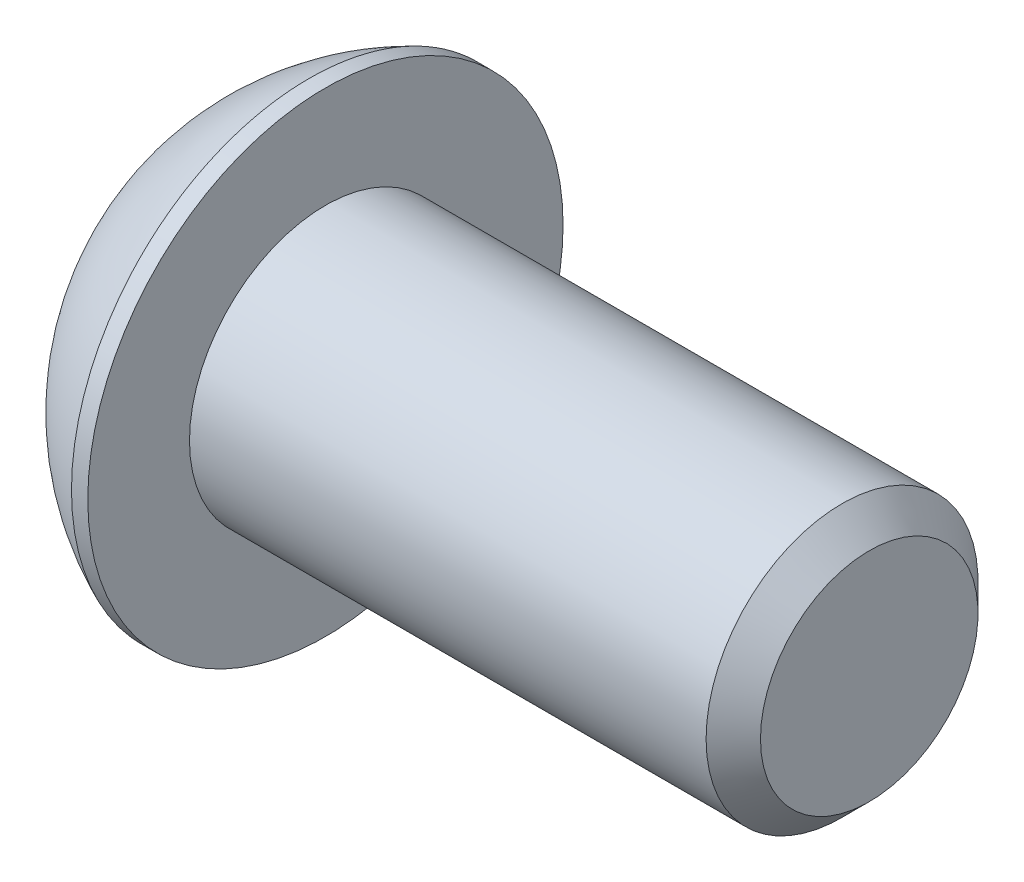
ISO-10303-21;
HEADER;
FILE_DESCRIPTION(('STEP AP214'),'2;1');
FILE_NAME('part.step','',(''),(''),'','','');
FILE_SCHEMA(('AUTOMOTIVE_DESIGN { 1 0 10303 214 1 1 1 1 }'));
ENDSEC;
DATA;
#1=APPLICATION_CONTEXT('core data for automotive mechanical design processes');
#2=APPLICATION_PROTOCOL_DEFINITION('international standard','automotive_design',2000,#1);
#3=PRODUCT_CONTEXT('',#1,'mechanical');
#4=PRODUCT('Part','Part','',(#3));
#5=PRODUCT_RELATED_PRODUCT_CATEGORY('part','',(#4));
#6=PRODUCT_DEFINITION_FORMATION('','',#4);
#7=PRODUCT_DEFINITION_CONTEXT('part definition',#1,'design');
#8=PRODUCT_DEFINITION('design','',#6,#7);
#9=PRODUCT_DEFINITION_SHAPE('','',#8);
#10=(LENGTH_UNIT() NAMED_UNIT(*) SI_UNIT(.MILLI.,.METRE.));
#11=(NAMED_UNIT(*) PLANE_ANGLE_UNIT() SI_UNIT($,.RADIAN.));
#12=(NAMED_UNIT(*) SI_UNIT($,.STERADIAN.) SOLID_ANGLE_UNIT());
#13=UNCERTAINTY_MEASURE_WITH_UNIT(LENGTH_MEASURE(1.E-05),#10,'distance_accuracy_value','');
#14=(GEOMETRIC_REPRESENTATION_CONTEXT(3) GLOBAL_UNCERTAINTY_ASSIGNED_CONTEXT((#13)) GLOBAL_UNIT_ASSIGNED_CONTEXT((#10,
#11,#12)) REPRESENTATION_CONTEXT('',''));
#15=CARTESIAN_POINT('',(0.,0.,0.));
#16=DIRECTION('',(0.,0.,1.));
#17=DIRECTION('',(1.,0.,0.));
#18=AXIS2_PLACEMENT_3D('',#15,#16,#17);
#19=CARTESIAN_POINT('',(1.32080000000034,0.,0.));
#20=DIRECTION('',(-1.,0.,0.));
#21=DIRECTION('',(0.,0.,1.));
#22=AXIS2_PLACEMENT_3D('',#19,#20,#21);
#23=CONICAL_SURFACE('',#22,1.1937999999998,1.04719755119608);
#24=CARTESIAN_POINT('',(2.01004075135902,0.,-4.44089209850063E-13));
#25=VERTEX_POINT('',#24);
#26=VERTEX_LOOP('',#25);
#27=FACE_BOUND('',#26,.T.);
#28=CARTESIAN_POINT('',(1.32080000000009,0.,0.));
#29=DIRECTION('',(-1.,0.,0.));
#30=DIRECTION('',(0.,0.,1.));
#31=AXIS2_PLACEMENT_3D('',#28,#29,#30);
#32=CIRCLE('',#31,1.19380000000024);
#33=CARTESIAN_POINT('',(1.32080000000009,0.,1.19380000000024));
#34=VERTEX_POINT('',#33);
#35=EDGE_CURVE('E20',#34,#34,#32,.T.);
#36=ORIENTED_EDGE('',*,*,#35,.T.);
#37=EDGE_LOOP('',(#36));
#38=FACE_BOUND('',#37,.T.);
#39=ADVANCED_FACE('F17',(#27,#38),#23,.F.);
#40=CARTESIAN_POINT('',(1.3208,-2.29135888084633,0.));
#41=DIRECTION('',(1.,0.,0.));
#42=DIRECTION('',(0.,0.,-1.));
#43=AXIS2_PLACEMENT_3D('',#40,#41,#42);
#44=PLANE('',#43);
#45=DIRECTION('',(0.,1.,0.));
#46=VECTOR('',#45,1.);
#47=CARTESIAN_POINT('',(1.3208,-1.14567944042316,1.984375));
#48=LINE('',#47,#46);
#49=CARTESIAN_POINT('',(1.3208,1.14567944042316,1.984375));
#50=VERTEX_POINT('',#49);
#51=CARTESIAN_POINT('',(1.3208,-1.14567944042316,1.984375));
#52=VERTEX_POINT('',#51);
#53=EDGE_CURVE('E69',#50,#52,#48,.F.);
#54=ORIENTED_EDGE('',*,*,#53,.F.);
#55=DIRECTION('',(0.,0.5,-0.866025403784439));
#56=VECTOR('',#55,1.);
#57=CARTESIAN_POINT('',(1.3208,1.14567944042316,1.984375));
#58=LINE('',#57,#56);
#59=CARTESIAN_POINT('',(1.3208,2.29135888084633,0.));
#60=VERTEX_POINT('',#59);
#61=EDGE_CURVE('E292',#60,#50,#58,.F.);
#62=ORIENTED_EDGE('',*,*,#61,.F.);
#63=DIRECTION('',(0.,-0.5,-0.866025403784439));
#64=VECTOR('',#63,1.);
#65=CARTESIAN_POINT('',(1.3208,2.29135888084633,0.));
#66=LINE('',#65,#64);
#67=CARTESIAN_POINT('',(1.3208,1.14567944042316,-1.984375));
#68=VERTEX_POINT('',#67);
#69=EDGE_CURVE('E296',#68,#60,#66,.F.);
#70=ORIENTED_EDGE('',*,*,#69,.F.);
#71=DIRECTION('',(0.,1.,0.));
#72=VECTOR('',#71,1.);
#73=CARTESIAN_POINT('',(1.3208,1.14567944042316,-1.984375));
#74=LINE('',#73,#72);
#75=CARTESIAN_POINT('',(1.3208,-1.14567944042316,-1.984375));
#76=VERTEX_POINT('',#75);
#77=EDGE_CURVE('E301',#76,#68,#74,.T.);
#78=ORIENTED_EDGE('',*,*,#77,.F.);
#79=DIRECTION('',(0.,-0.500000000000001,0.866025403784438));
#80=VECTOR('',#79,1.);
#81=CARTESIAN_POINT('',(1.3208,-1.14567944042316,-1.984375));
#82=LINE('',#81,#80);
#83=CARTESIAN_POINT('',(1.3208,-2.29135888084633,0.));
#84=VERTEX_POINT('',#83);
#85=EDGE_CURVE('E306',#84,#76,#82,.F.);
#86=ORIENTED_EDGE('',*,*,#85,.F.);
#87=DIRECTION('',(0.,0.500000000000001,0.866025403784438));
#88=VECTOR('',#87,1.);
#89=CARTESIAN_POINT('',(1.3208,-2.29135888084633,0.));
#90=LINE('',#89,#88);
#91=EDGE_CURVE('E82',#52,#84,#90,.F.);
#92=ORIENTED_EDGE('',*,*,#91,.F.);
#93=EDGE_LOOP('',(#54,#62,#70,#78,#86,#92));
#94=FACE_BOUND('',#93,.T.);
#95=ORIENTED_EDGE('',*,*,#35,.F.);
#96=EDGE_LOOP('',(#95));
#97=FACE_BOUND('',#96,.T.);
#98=ADVANCED_FACE('F75',(#94,#97),#44,.F.);
#99=CARTESIAN_POINT('',(1.3208,-1.14567944042316,1.984375));
#100=DIRECTION('',(0.,0.,-1.));
#101=DIRECTION('',(0.,1.,0.));
#102=AXIS2_PLACEMENT_3D('',#99,#100,#101);
#103=PLANE('',#102);
#104=ORIENTED_EDGE('',*,*,#53,.T.);
#105=DIRECTION('',(1.,0.,0.));
#106=VECTOR('',#105,1.);
#107=CARTESIAN_POINT('',(1.3208,-1.14567944042316,1.984375));
#108=LINE('',#107,#106);
#109=CARTESIAN_POINT('',(0.,-1.14567944042316,1.984375));
#110=VERTEX_POINT('',#109);
#111=EDGE_CURVE('E79',#110,#52,#108,.T.);
#112=ORIENTED_EDGE('',*,*,#111,.F.);
#113=DIRECTION('',(0.,1.,0.));
#114=VECTOR('',#113,1.);
#115=CARTESIAN_POINT('',(0.,0.,1.984375));
#116=LINE('',#115,#114);
#117=CARTESIAN_POINT('',(0.,1.14567944042316,1.984375));
#118=VERTEX_POINT('',#117);
#119=EDGE_CURVE('E286',#118,#110,#116,.F.);
#120=ORIENTED_EDGE('',*,*,#119,.F.);
#121=DIRECTION('',(1.,0.,0.));
#122=VECTOR('',#121,1.);
#123=CARTESIAN_POINT('',(1.3208,1.14567944042316,1.984375));
#124=LINE('',#123,#122);
#125=EDGE_CURVE('E289',#50,#118,#124,.F.);
#126=ORIENTED_EDGE('',*,*,#125,.F.);
#127=EDGE_LOOP('',(#104,#112,#120,#126));
#128=FACE_BOUND('',#127,.T.);
#129=ADVANCED_FACE('F128',(#128),#103,.T.);
#130=CARTESIAN_POINT('',(1.3208,-2.29135888084633,0.));
#131=DIRECTION('',(0.,0.866025403784438,-0.500000000000001));
#132=DIRECTION('',(0.,0.500000000000001,0.866025403784438));
#133=AXIS2_PLACEMENT_3D('',#130,#131,#132);
#134=PLANE('',#133);
#135=ORIENTED_EDGE('',*,*,#91,.T.);
#136=DIRECTION('',(1.,0.,0.));
#137=VECTOR('',#136,1.);
#138=CARTESIAN_POINT('',(1.3208,-2.29135888084633,0.));
#139=LINE('',#138,#137);
#140=CARTESIAN_POINT('',(0.,-2.29135888084633,0.));
#141=VERTEX_POINT('',#140);
#142=EDGE_CURVE('E308',#141,#84,#139,.T.);
#143=ORIENTED_EDGE('',*,*,#142,.F.);
#144=DIRECTION('',(0.,-0.500000000000001,-0.866025403784438));
#145=VECTOR('',#144,1.);
#146=CARTESIAN_POINT('',(0.,-1.14567944042316,1.984375));
#147=LINE('',#146,#145);
#148=EDGE_CURVE('E283',#110,#141,#147,.T.);
#149=ORIENTED_EDGE('',*,*,#148,.F.);
#150=ORIENTED_EDGE('',*,*,#111,.T.);
#151=EDGE_LOOP('',(#135,#143,#149,#150));
#152=FACE_BOUND('',#151,.T.);
#153=ADVANCED_FACE('F124',(#152),#134,.T.);
#154=CARTESIAN_POINT('',(1.3208,-1.14567944042316,-1.984375));
#155=DIRECTION('',(0.,0.866025403784438,0.500000000000001));
#156=DIRECTION('',(0.,-0.500000000000001,0.866025403784438));
#157=AXIS2_PLACEMENT_3D('',#154,#155,#156);
#158=PLANE('',#157);
#159=ORIENTED_EDGE('',*,*,#85,.T.);
#160=DIRECTION('',(1.,0.,0.));
#161=VECTOR('',#160,1.);
#162=CARTESIAN_POINT('',(1.3208,-1.14567944042316,-1.984375));
#163=LINE('',#162,#161);
#164=CARTESIAN_POINT('',(0.,-1.14567944042316,-1.984375));
#165=VERTEX_POINT('',#164);
#166=EDGE_CURVE('E303',#165,#76,#163,.T.);
#167=ORIENTED_EDGE('',*,*,#166,.F.);
#168=DIRECTION('',(0.,0.500000000000001,-0.866025403784438));
#169=VECTOR('',#168,1.);
#170=CARTESIAN_POINT('',(0.,-2.29135888084633,0.));
#171=LINE('',#170,#169);
#172=EDGE_CURVE('E280',#141,#165,#171,.T.);
#173=ORIENTED_EDGE('',*,*,#172,.F.);
#174=ORIENTED_EDGE('',*,*,#142,.T.);
#175=EDGE_LOOP('',(#159,#167,#173,#174));
#176=FACE_BOUND('',#175,.T.);
#177=ADVANCED_FACE('F120',(#176),#158,.T.);
#178=CARTESIAN_POINT('',(1.3208,1.14567944042316,-1.984375));
#179=DIRECTION('',(0.,0.,1.));
#180=DIRECTION('',(1.,0.,0.));
#181=AXIS2_PLACEMENT_3D('',#178,#179,#180);
#182=PLANE('',#181);
#183=ORIENTED_EDGE('',*,*,#77,.T.);
#184=DIRECTION('',(1.,0.,0.));
#185=VECTOR('',#184,1.);
#186=CARTESIAN_POINT('',(1.3208,1.14567944042316,-1.984375));
#187=LINE('',#186,#185);
#188=CARTESIAN_POINT('',(0.,1.14567944042316,-1.984375));
#189=VERTEX_POINT('',#188);
#190=EDGE_CURVE('E298',#189,#68,#187,.T.);
#191=ORIENTED_EDGE('',*,*,#190,.F.);
#192=DIRECTION('',(0.,1.,0.));
#193=VECTOR('',#192,1.);
#194=CARTESIAN_POINT('',(0.,0.,-1.984375));
#195=LINE('',#194,#193);
#196=EDGE_CURVE('E277',#165,#189,#195,.T.);
#197=ORIENTED_EDGE('',*,*,#196,.F.);
#198=ORIENTED_EDGE('',*,*,#166,.T.);
#199=EDGE_LOOP('',(#183,#191,#197,#198));
#200=FACE_BOUND('',#199,.T.);
#201=ADVANCED_FACE('F117',(#200),#182,.T.);
#202=CARTESIAN_POINT('',(1.3208,2.29135888084633,0.));
#203=DIRECTION('',(0.,-0.866025403784439,0.5));
#204=DIRECTION('',(0.,-0.5,-0.866025403784439));
#205=AXIS2_PLACEMENT_3D('',#202,#203,#204);
#206=PLANE('',#205);
#207=ORIENTED_EDGE('',*,*,#69,.T.);
#208=DIRECTION('',(1.,0.,0.));
#209=VECTOR('',#208,1.);
#210=CARTESIAN_POINT('',(1.3208,2.29135888084633,0.));
#211=LINE('',#210,#209);
#212=CARTESIAN_POINT('',(0.,2.29135888084633,0.));
#213=VERTEX_POINT('',#212);
#214=EDGE_CURVE('E35',#213,#60,#211,.T.);
#215=ORIENTED_EDGE('',*,*,#214,.F.);
#216=DIRECTION('',(0.,0.5,0.866025403784439));
#217=VECTOR('',#216,1.);
#218=CARTESIAN_POINT('',(0.,1.14567944042316,-1.984375));
#219=LINE('',#218,#217);
#220=EDGE_CURVE('E274',#189,#213,#219,.T.);
#221=ORIENTED_EDGE('',*,*,#220,.F.);
#222=ORIENTED_EDGE('',*,*,#190,.T.);
#223=EDGE_LOOP('',(#207,#215,#221,#222));
#224=FACE_BOUND('',#223,.T.);
#225=ADVANCED_FACE('F113',(#224),#206,.T.);
#226=CARTESIAN_POINT('',(1.3208,1.14567944042316,1.984375));
#227=DIRECTION('',(0.,-0.866025403784439,-0.5));
#228=DIRECTION('',(0.,0.5,-0.866025403784439));
#229=AXIS2_PLACEMENT_3D('',#226,#227,#228);
#230=PLANE('',#229);
#231=ORIENTED_EDGE('',*,*,#61,.T.);
#232=ORIENTED_EDGE('',*,*,#125,.T.);
#233=DIRECTION('',(0.,-0.5,0.866025403784438));
#234=VECTOR('',#233,1.);
#235=CARTESIAN_POINT('',(0.,2.29135888084633,0.));
#236=LINE('',#235,#234);
#237=EDGE_CURVE('E100',#213,#118,#236,.T.);
#238=ORIENTED_EDGE('',*,*,#237,.F.);
#239=ORIENTED_EDGE('',*,*,#214,.T.);
#240=EDGE_LOOP('',(#231,#232,#238,#239));
#241=FACE_BOUND('',#240,.T.);
#242=ADVANCED_FACE('F109',(#241),#230,.T.);
#243=CARTESIAN_POINT('',(0.,0.,0.));
#244=DIRECTION('',(-1.,0.,0.));
#245=DIRECTION('',(0.,0.,1.));
#246=AXIS2_PLACEMENT_3D('',#243,#244,#245);
#247=PLANE('',#246);
#248=ORIENTED_EDGE('',*,*,#220,.T.);
#249=ORIENTED_EDGE('',*,*,#237,.T.);
#250=ORIENTED_EDGE('',*,*,#119,.T.);
#251=ORIENTED_EDGE('',*,*,#148,.T.);
#252=ORIENTED_EDGE('',*,*,#172,.T.);
#253=ORIENTED_EDGE('',*,*,#196,.T.);
#254=EDGE_LOOP('',(#248,#249,#250,#251,#252,#253));
#255=FACE_BOUND('',#254,.T.);
#256=CARTESIAN_POINT('',(0.,2.77495,0.));
#257=CARTESIAN_POINT('',(0.,2.77494953309947,0.0779118937523459));
#258=CARTESIAN_POINT('',(0.,2.77166578388025,0.15583810591977));
#259=CARTESIAN_POINT('',(0.,2.75855213600204,0.311152012455904));
#260=CARTESIAN_POINT('',(0.,2.74872030471467,0.388539541019556));
#261=CARTESIAN_POINT('',(0.,2.72255472645676,0.542341518735717));
#262=CARTESIAN_POINT('',(-2.70414110576258E-13,2.70621065843663,0.618754223567578));
#263=CARTESIAN_POINT('',(2.71501725221868E-13,2.66713326915777,0.769973634286023));
#264=CARTESIAN_POINT('',(1.01274952524446E-12,2.64439476297869,0.844778983646282));
#265=CARTESIAN_POINT('',(1.81909959813207E-12,2.56690195943351,1.06566239301792));
#266=CARTESIAN_POINT('',(4.77081687541822E-13,2.50280672569928,1.20857954243987));
#267=CARTESIAN_POINT('',(-4.76232447128612E-13,2.35149826934097,1.48160874561538));
#268=CARTESIAN_POINT('',(0.,2.26428416790397,1.61172031233499));
#269=CARTESIAN_POINT('',(0.,2.1181093928834,1.79445660654268));
#270=CARTESIAN_POINT('',(0.,2.06678693791626,1.85333128513996));
#271=CARTESIAN_POINT('',(0.,1.95940522984449,1.96650727912792));
#272=CARTESIAN_POINT('',(0.,1.90335059143535,2.02081294920044));
#273=CARTESIAN_POINT('',(0.,1.78683891013963,2.12453280878582));
#274=CARTESIAN_POINT('',(0.,1.72637988450322,2.1739447713554));
#275=CARTESIAN_POINT('',(0.,1.60151968865711,2.26750481692908));
#276=CARTESIAN_POINT('',(0.,1.53711760864537,2.31165167810847));
#277=CARTESIAN_POINT('',(0.,1.33869902291632,2.43567242603944));
#278=CARTESIAN_POINT('',(0.,1.19934704110695,2.507235886628));
#279=CARTESIAN_POINT('',(0.,0.910681609121881,2.62590828672821));
#280=CARTESIAN_POINT('',(0.,0.761368265357398,2.67301748742278));
#281=CARTESIAN_POINT('',(0.,0.456932649466623,2.74151230664007));
#282=CARTESIAN_POINT('',(0.,0.301810346322584,2.76289778778721));
#283=CARTESIAN_POINT('',(0.,-0.00982263870895171,2.77931595661156));
#284=CARTESIAN_POINT('',(0.,-0.166333320596448,2.77434864428877));
#285=CARTESIAN_POINT('',(0.,-0.476280836814452,2.73822217653073));
#286=CARTESIAN_POINT('',(0.,-0.629717687555985,2.70706316096981));
#287=CARTESIAN_POINT('',(0.,-0.929254830044274,2.61937980771149));
#288=CARTESIAN_POINT('',(0.,-1.0753550434132,2.56285519909568));
#289=CARTESIAN_POINT('',(0.,-1.28570692598579,2.46037024128109));
#290=CARTESIAN_POINT('',(0.,-1.35439130022287,2.42323494812896));
#291=CARTESIAN_POINT('',(0.,-1.488391287199,2.34331277270256));
#292=CARTESIAN_POINT('',(0.,-1.55370767631787,2.30052720108831));
#293=CARTESIAN_POINT('',(0.,-1.68047292776594,2.20962421887055));
#294=CARTESIAN_POINT('',(0.,-1.7419235278682,2.16150923122348));
#295=CARTESIAN_POINT('',(0.,-1.86060297067992,2.06024311301283));
#296=CARTESIAN_POINT('',(0.,-1.91782768181715,2.0070871669763));
#297=CARTESIAN_POINT('',(0.,-2.08239462196651,1.8407220856554));
#298=CARTESIAN_POINT('',(0.,-2.18279764272601,1.72049499758422));
#299=CARTESIAN_POINT('',(0.,-2.36195754944063,1.46487629213018));
#300=CARTESIAN_POINT('',(0.,-2.44071525816758,1.32948525142807));
#301=CARTESIAN_POINT('',(0.,-2.54098882695274,1.11796734074395));
#302=CARTESIAN_POINT('',(0.,-2.57146177392727,1.04596540008347));
#303=CARTESIAN_POINT('',(0.,-2.62621251108999,0.899689259475764));
#304=CARTESIAN_POINT('',(0.,-2.65049531495563,0.825416953360952));
#305=CARTESIAN_POINT('',(0.,-2.69267708798766,0.675215808695207));
#306=CARTESIAN_POINT('',(0.,-2.71058613777937,0.599289789313092));
#307=CARTESIAN_POINT('',(0.,-2.73994710360127,0.446213628496932));
#308=CARTESIAN_POINT('',(0.,-2.75140092413871,0.369063855024788));
#309=CARTESIAN_POINT('',(0.,-2.76470470685522,0.24316208817343));
#310=CARTESIAN_POINT('',(0.,-2.76854547596618,0.194611672428577));
#311=CARTESIAN_POINT('',(0.,-2.77366826843264,0.0973760351839812));
#312=CARTESIAN_POINT('',(0.,-2.77495029178814,0.0486908136842395));
#313=CARTESIAN_POINT('',(0.,-2.77494953309947,-0.0779118937523475));
#314=CARTESIAN_POINT('',(0.,-2.77166578388025,-0.155838105919772));
#315=CARTESIAN_POINT('',(0.,-2.75855213600204,-0.311152012455906));
#316=CARTESIAN_POINT('',(0.,-2.74872030471467,-0.388539541019558));
#317=CARTESIAN_POINT('',(0.,-2.72255472645677,-0.542341518735719));
#318=CARTESIAN_POINT('',(-2.70149297926331E-13,-2.70621065843663,-0.61875422356758));
#319=CARTESIAN_POINT('',(2.712366972268E-13,-2.66713326915777,-0.769973634286024));
#320=CARTESIAN_POINT('',(1.0114146773846E-12,-2.64439476297869,-0.844778983646283));
#321=CARTESIAN_POINT('',(1.81656702958366E-12,-2.5669019594335,-1.06566239301792));
#322=CARTESIAN_POINT('',(4.7641829195856E-13,-2.50280672569928,-1.20857954243988));
#323=CARTESIAN_POINT('',(-4.75569026324205E-13,-2.35149826934097,-1.48160874561538));
#324=CARTESIAN_POINT('',(0.,-2.26428416790396,-1.61172031233499));
#325=CARTESIAN_POINT('',(0.,-2.1181093928834,-1.79445660654268));
#326=CARTESIAN_POINT('',(0.,-2.06678693791626,-1.85333128513997));
#327=CARTESIAN_POINT('',(0.,-1.95940522984449,-1.96650727912792));
#328=CARTESIAN_POINT('',(0.,-1.90335059143535,-2.02081294920044));
#329=CARTESIAN_POINT('',(0.,-1.78683891013963,-2.12453280878582));
#330=CARTESIAN_POINT('',(0.,-1.72637988450322,-2.1739447713554));
#331=CARTESIAN_POINT('',(0.,-1.60151968865711,-2.26750481692908));
#332=CARTESIAN_POINT('',(0.,-1.53711760864537,-2.31165167810847));
#333=CARTESIAN_POINT('',(0.,-1.33869902291632,-2.43567242603944));
#334=CARTESIAN_POINT('',(0.,-1.19934704110695,-2.507235886628));
#335=CARTESIAN_POINT('',(0.,-0.91068160912188,-2.62590828672821));
#336=CARTESIAN_POINT('',(0.,-0.761368265357396,-2.67301748742278));
#337=CARTESIAN_POINT('',(0.,-0.456932649466621,-2.74151230664007));
#338=CARTESIAN_POINT('',(0.,-0.301810346322582,-2.76289778778721));
#339=CARTESIAN_POINT('',(0.,0.00982263870895353,-2.77931595661156));
#340=CARTESIAN_POINT('',(0.,0.16633332059645,-2.77434864428876));
#341=CARTESIAN_POINT('',(0.,0.476280836814454,-2.73822217653073));
#342=CARTESIAN_POINT('',(0.,0.629717687555987,-2.70706316096981));
#343=CARTESIAN_POINT('',(0.,0.929254830044276,-2.6193798077115));
#344=CARTESIAN_POINT('',(0.,1.0753550434132,-2.56285519909568));
#345=CARTESIAN_POINT('',(0.,1.28570692598579,-2.46037024128109));
#346=CARTESIAN_POINT('',(0.,1.35439130022287,-2.42323494812896));
#347=CARTESIAN_POINT('',(0.,1.488391287199,-2.34331277270256));
#348=CARTESIAN_POINT('',(0.,1.55370767631787,-2.30052720108831));
#349=CARTESIAN_POINT('',(0.,1.68047292776594,-2.20962421887055));
#350=CARTESIAN_POINT('',(0.,1.7419235278682,-2.16150923122348));
#351=CARTESIAN_POINT('',(0.,1.86060297067992,-2.06024311301282));
#352=CARTESIAN_POINT('',(0.,1.91782768181716,-2.0070871669763));
#353=CARTESIAN_POINT('',(0.,2.08239462196651,-1.8407220856554));
#354=CARTESIAN_POINT('',(0.,2.18279764272601,-1.72049499758422));
#355=CARTESIAN_POINT('',(0.,2.36195754944063,-1.46487629213018));
#356=CARTESIAN_POINT('',(0.,2.44071525816757,-1.32948525142807));
#357=CARTESIAN_POINT('',(0.,2.54098882695273,-1.11796734074395));
#358=CARTESIAN_POINT('',(0.,2.57146177392727,-1.04596540008347));
#359=CARTESIAN_POINT('',(0.,2.62621251108999,-0.899689259475765));
#360=CARTESIAN_POINT('',(0.,2.65049531495563,-0.825416953360953));
#361=CARTESIAN_POINT('',(0.,2.69267708798766,-0.675215808695207));
#362=CARTESIAN_POINT('',(0.,2.71058613777936,-0.599289789313092));
#363=CARTESIAN_POINT('',(0.,2.73994710360127,-0.446213628496932));
#364=CARTESIAN_POINT('',(0.,2.75140092413871,-0.369063855024789));
#365=CARTESIAN_POINT('',(0.,2.76470470685522,-0.243162088173432));
#366=CARTESIAN_POINT('',(0.,2.76854547596618,-0.194611672428578));
#367=CARTESIAN_POINT('',(0.,2.77366826843264,-0.0973760351839823));
#368=CARTESIAN_POINT('',(0.,2.77495029178814,-0.0486908136842408));
#369=CARTESIAN_POINT('',(0.,2.77495,0.));
#370=B_SPLINE_CURVE_WITH_KNOTS('',3,(#256,#257,#258,#259,#260,#261,#262,#263,#264,#265,#266,
#267,#268,#269,#270,#271,#272,#273,#274,#275,#276,#277,#278,#279,#280,#281,#282,#283,#284,#285,
#286,#287,#288,#289,#290,#291,#292,#293,#294,#295,#296,#297,#298,#299,#300,#301,#302,#303,#304,
#305,#306,#307,#308,#309,#310,#311,#312,#313,#314,#315,#316,#317,#318,#319,#320,#321,#322,#323,
#324,#325,#326,#327,#328,#329,#330,#331,#332,#333,#334,#335,#336,#337,#338,#339,#340,#341,#342,
#343,#344,#345,#346,#347,#348,#349,#350,#351,#352,#353,#354,#355,#356,#357,#358,#359,#360,#361,
#362,#363,#364,#365,#366,#367,#368,#369),.UNSPECIFIED.,.T.,.F.,(4,2,2,2,2,2,2,2,2,2,2,2,2,2,2,2,
2,2,2,2,2,2,2,2,2,2,2,2,2,2,2,2,2,2,2,2,2,2,2,2,2,2,2,2,2,2,2,2,2,2,2,2,2,2,2,2,4),(0.,
0.233690856748162,0.467450716578751,0.701582538521471,0.935904756015414,1.40343220467667,
1.87097742791502,2.10505636898837,2.33890962270652,2.57286880998746,2.80688218486306,
3.27442101763127,3.74195485676357,4.20949119271389,4.67702752866417,5.14456136779641,
5.61210020056468,5.84611357544033,6.08007276272136,6.31392601643949,6.54800495751273,
7.01555018075072,7.48307762941212,7.71739984690652,7.95153166884955,8.18529152868023,
8.41898238542855,8.56502681353347,8.71107124163843,8.94476209838659,9.17852195821718,
9.4126537801599,9.64697599765384,10.1145034463151,10.5820486695534,10.8161276106268,
11.0499808643449,11.2839400516259,11.5179534265015,11.9854922592697,12.453026098402,
12.9205624343523,13.3880987703026,13.8556326094348,14.3231714422031,14.5571848170788,
14.7911440043598,15.0249972580779,15.2590761991512,15.7266214223891,16.1941488710506,
16.4284710885449,16.662602910488,16.8963627703186,17.130053627067,17.2760980551719,
17.4221424832769),.UNSPECIFIED.);
#371=CARTESIAN_POINT('',(0.,2.77495,0.));
#372=VERTEX_POINT('',#371);
#373=EDGE_CURVE('E94',#372,#372,#370,.T.);
#374=ORIENTED_EDGE('',*,*,#373,.F.);
#375=EDGE_LOOP('',(#374));
#376=FACE_BOUND('',#375,.T.);
#377=ADVANCED_FACE('F105',(#255,#376),#247,.T.);
#378=CARTESIAN_POINT('',(5.37260881410256,0.,0.));
#379=DIRECTION('',(0.,1.,0.));
#380=DIRECTION('',(1.,0.,0.));
#381=AXIS2_PLACEMENT_3D('',#378,#379,#380);
#382=SPHERICAL_SURFACE('',#381,6.04692260342999);
#383=CARTESIAN_POINT('',(2.9718,0.,0.));
#384=DIRECTION('',(-1.,0.,0.));
#385=DIRECTION('',(0.,0.,1.));
#386=AXIS2_PLACEMENT_3D('',#383,#384,#385);
#387=CIRCLE('',#386,5.5499);
#388=CARTESIAN_POINT('',(2.9718,0.,5.5499));
#389=VERTEX_POINT('',#388);
#390=EDGE_CURVE('E92',#389,#389,#387,.F.);
#391=ORIENTED_EDGE('',*,*,#390,.F.);
#392=EDGE_LOOP('',(#391));
#393=FACE_BOUND('',#392,.T.);
#394=ORIENTED_EDGE('',*,*,#373,.T.);
#395=EDGE_LOOP('',(#394));
#396=FACE_BOUND('',#395,.T.);
#397=ADVANCED_FACE('F101',(#393,#396),#382,.T.);
#398=CARTESIAN_POINT('',(16.0528,0.,0.));
#399=DIRECTION('',(-1.,0.,0.));
#400=DIRECTION('',(0.,0.,1.));
#401=AXIS2_PLACEMENT_3D('',#398,#399,#400);
#402=PLANE('',#401);
#403=CARTESIAN_POINT('',(16.0528000000681,0.,0.));
#404=DIRECTION('',(-1.,0.,0.));
#405=DIRECTION('',(0.,0.,1.));
#406=AXIS2_PLACEMENT_3D('',#403,#404,#405);
#407=CIRCLE('',#406,2.54000000001042);
#408=CARTESIAN_POINT('',(16.0528000000681,0.,2.54000000001042));
#409=VERTEX_POINT('',#408);
#410=EDGE_CURVE('E89',#409,#409,#407,.T.);
#411=ORIENTED_EDGE('',*,*,#410,.F.);
#412=EDGE_LOOP('',(#411));
#413=FACE_BOUND('',#412,.T.);
#414=ADVANCED_FACE('F154',(#413),#402,.F.);
#415=CARTESIAN_POINT('',(0.,0.,0.));
#416=DIRECTION('',(-1.,0.,0.));
#417=DIRECTION('',(0.,0.,1.));
#418=AXIS2_PLACEMENT_3D('',#415,#416,#417);
#419=CYLINDRICAL_SURFACE('',#418,5.5499);
#420=ORIENTED_EDGE('',*,*,#390,.T.);
#421=EDGE_LOOP('',(#420));
#422=FACE_BOUND('',#421,.T.);
#423=CARTESIAN_POINT('',(3.3528,0.,0.));
#424=DIRECTION('',(-1.,0.,0.));
#425=DIRECTION('',(0.,0.,1.));
#426=AXIS2_PLACEMENT_3D('',#423,#424,#425);
#427=CIRCLE('',#426,5.5499);
#428=CARTESIAN_POINT('',(3.3528,0.,5.5499));
#429=VERTEX_POINT('',#428);
#430=EDGE_CURVE('E86',#429,#429,#427,.T.);
#431=ORIENTED_EDGE('',*,*,#430,.T.);
#432=EDGE_LOOP('',(#431));
#433=FACE_BOUND('',#432,.T.);
#434=ADVANCED_FACE('F151',(#422,#433),#419,.T.);
#435=CARTESIAN_POINT('',(15.4178000000229,0.,0.));
#436=DIRECTION('',(-1.,0.,0.));
#437=DIRECTION('',(0.,0.,1.));
#438=AXIS2_PLACEMENT_3D('',#435,#436,#437);
#439=CONICAL_SURFACE('',#438,3.17500000005566,0.785398163397448);
#440=CARTESIAN_POINT('',(15.4178,0.,0.));
#441=DIRECTION('',(-1.,0.,0.));
#442=DIRECTION('',(0.,0.,1.));
#443=AXIS2_PLACEMENT_3D('',#440,#441,#442);
#444=CIRCLE('',#443,3.175);
#445=CARTESIAN_POINT('',(15.4178,0.,3.175));
#446=VERTEX_POINT('',#445);
#447=EDGE_CURVE('E26',#446,#446,#444,.T.);
#448=ORIENTED_EDGE('',*,*,#447,.F.);
#449=EDGE_LOOP('',(#448));
#450=FACE_BOUND('',#449,.T.);
#451=ORIENTED_EDGE('',*,*,#410,.T.);
#452=EDGE_LOOP('',(#451));
#453=FACE_BOUND('',#452,.T.);
#454=ADVANCED_FACE('F144',(#450,#453),#439,.T.);
#455=CARTESIAN_POINT('',(3.3528,3.175,0.));
#456=DIRECTION('',(-1.,0.,0.));
#457=DIRECTION('',(0.,0.,1.));
#458=AXIS2_PLACEMENT_3D('',#455,#456,#457);
#459=PLANE('',#458);
#460=CARTESIAN_POINT('',(3.3528,0.,0.));
#461=DIRECTION('',(-1.,0.,0.));
#462=DIRECTION('',(0.,0.,1.));
#463=AXIS2_PLACEMENT_3D('',#460,#461,#462);
#464=CIRCLE('',#463,3.175);
#465=CARTESIAN_POINT('',(3.3528,0.,3.175));
#466=VERTEX_POINT('',#465);
#467=EDGE_CURVE('E11',#466,#466,#464,.F.);
#468=ORIENTED_EDGE('',*,*,#467,.F.);
#469=EDGE_LOOP('',(#468));
#470=FACE_BOUND('',#469,.T.);
#471=ORIENTED_EDGE('',*,*,#430,.F.);
#472=EDGE_LOOP('',(#471));
#473=FACE_BOUND('',#472,.T.);
#474=ADVANCED_FACE('F138',(#470,#473),#459,.F.);
#475=CARTESIAN_POINT('',(0.,0.,0.));
#476=DIRECTION('',(-1.,0.,0.));
#477=DIRECTION('',(0.,0.,1.));
#478=AXIS2_PLACEMENT_3D('',#475,#476,#477);
#479=CYLINDRICAL_SURFACE('',#478,3.175);
#480=ORIENTED_EDGE('',*,*,#467,.T.);
#481=EDGE_LOOP('',(#480));
#482=FACE_BOUND('',#481,.T.);
#483=ORIENTED_EDGE('',*,*,#447,.T.);
#484=EDGE_LOOP('',(#483));
#485=FACE_BOUND('',#484,.T.);
#486=ADVANCED_FACE('F136',(#482,#485),#479,.T.);
#487=CLOSED_SHELL('',(#39,#98,#129,#153,#177,#201,#225,#242,#377,#397,#414,#434,#454,#474,#486));
#488=MANIFOLD_SOLID_BREP('B1',#487);
#489=ADVANCED_BREP_SHAPE_REPRESENTATION('',(#18,#488),#14);
#490=SHAPE_DEFINITION_REPRESENTATION(#9,#489);
ENDSEC;
END-ISO-10303-21;
